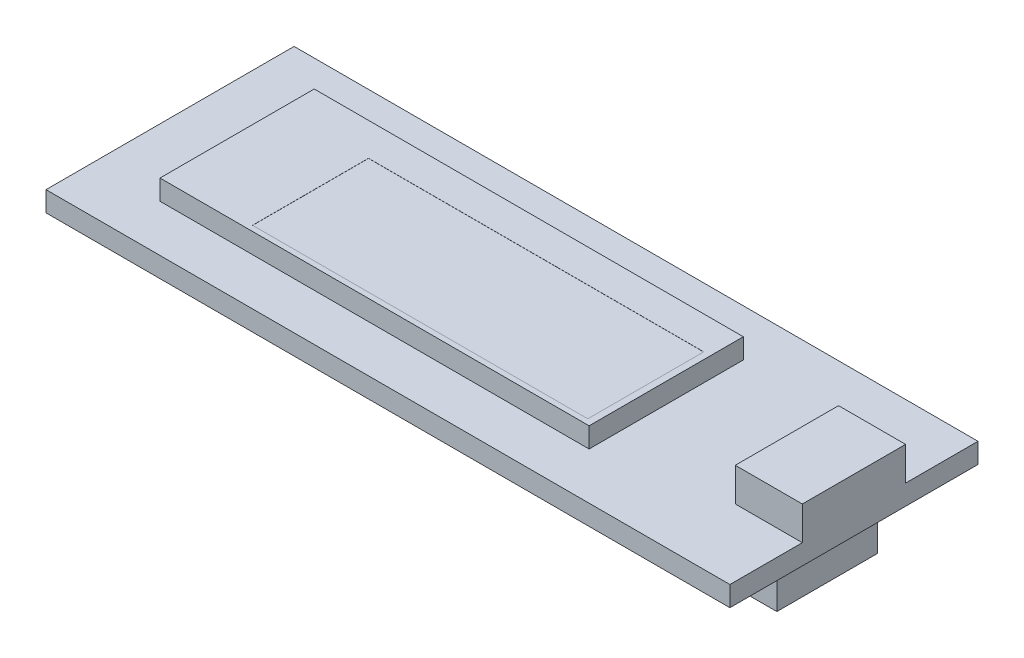
ISO-10303-21;
HEADER;
FILE_DESCRIPTION(('STEP AP214'),'2;1');
FILE_NAME('part.step','',(''),(''),'','','');
FILE_SCHEMA(('AUTOMOTIVE_DESIGN { 1 0 10303 214 1 1 1 1 }'));
ENDSEC;
DATA;
#1=APPLICATION_CONTEXT('core data for automotive mechanical design processes');
#2=APPLICATION_PROTOCOL_DEFINITION('international standard','automotive_design',2000,#1);
#3=PRODUCT_CONTEXT('',#1,'mechanical');
#4=PRODUCT('Part','Part','',(#3));
#5=PRODUCT_RELATED_PRODUCT_CATEGORY('part','',(#4));
#6=PRODUCT_DEFINITION_FORMATION('','',#4);
#7=PRODUCT_DEFINITION_CONTEXT('part definition',#1,'design');
#8=PRODUCT_DEFINITION('design','',#6,#7);
#9=PRODUCT_DEFINITION_SHAPE('','',#8);
#10=(LENGTH_UNIT() NAMED_UNIT(*) SI_UNIT(.MILLI.,.METRE.));
#11=(NAMED_UNIT(*) PLANE_ANGLE_UNIT() SI_UNIT($,.RADIAN.));
#12=(NAMED_UNIT(*) SI_UNIT($,.STERADIAN.) SOLID_ANGLE_UNIT());
#13=UNCERTAINTY_MEASURE_WITH_UNIT(LENGTH_MEASURE(1.E-05),#10,'distance_accuracy_value','');
#14=(GEOMETRIC_REPRESENTATION_CONTEXT(3) GLOBAL_UNCERTAINTY_ASSIGNED_CONTEXT((#13)) GLOBAL_UNIT_ASSIGNED_CONTEXT((#10,
#11,#12)) REPRESENTATION_CONTEXT('',''));
#15=CARTESIAN_POINT('',(0.,0.,0.));
#16=DIRECTION('',(0.,0.,1.));
#17=DIRECTION('',(1.,0.,0.));
#18=AXIS2_PLACEMENT_3D('',#15,#16,#17);
#19=CARTESIAN_POINT('',(0.,0.,0.));
#20=DIRECTION('',(0.,-1.,0.));
#21=DIRECTION('',(0.,0.,-1.));
#22=AXIS2_PLACEMENT_3D('',#19,#20,#21);
#23=PLANE('',#22);
#24=DIRECTION('',(1.,0.,0.));
#25=VECTOR('',#24,1.);
#26=CARTESIAN_POINT('',(0.,0.,-9.25));
#27=LINE('',#26,#25);
#28=CARTESIAN_POINT('',(0.,0.,-9.25));
#29=VERTEX_POINT('',#28);
#30=CARTESIAN_POINT('',(51.,0.,-9.25));
#31=VERTEX_POINT('',#30);
#32=EDGE_CURVE('E299',#29,#31,#27,.T.);
#33=ORIENTED_EDGE('',*,*,#32,.T.);
#34=DIRECTION('',(0.,0.,1.));
#35=VECTOR('',#34,1.);
#36=CARTESIAN_POINT('',(51.,0.,-9.25));
#37=LINE('',#36,#35);
#38=CARTESIAN_POINT('',(51.,0.,9.24999999999997));
#39=VERTEX_POINT('',#38);
#40=EDGE_CURVE('E315',#31,#39,#37,.T.);
#41=ORIENTED_EDGE('',*,*,#40,.T.);
#42=DIRECTION('',(1.,0.,0.));
#43=VECTOR('',#42,1.);
#44=CARTESIAN_POINT('',(0.,0.,9.25));
#45=LINE('',#44,#43);
#46=CARTESIAN_POINT('',(0.,0.,9.25));
#47=VERTEX_POINT('',#46);
#48=EDGE_CURVE('E318',#47,#39,#45,.T.);
#49=ORIENTED_EDGE('',*,*,#48,.F.);
#50=DIRECTION('',(0.,0.,1.));
#51=VECTOR('',#50,1.);
#52=CARTESIAN_POINT('',(0.,0.,-9.25));
#53=LINE('',#52,#51);
#54=EDGE_CURVE('E304',#29,#47,#53,.T.);
#55=ORIENTED_EDGE('',*,*,#54,.F.);
#56=EDGE_LOOP('',(#33,#41,#49,#55));
#57=FACE_BOUND('',#56,.T.);
#58=DIRECTION('',(1.,0.,0.));
#59=VECTOR('',#58,1.);
#60=CARTESIAN_POINT('',(44.7,0.,-3.75));
#61=LINE('',#60,#59);
#62=CARTESIAN_POINT('',(44.7,0.,-3.75));
#63=VERTEX_POINT('',#62);
#64=CARTESIAN_POINT('',(49.,0.,-3.75));
#65=VERTEX_POINT('',#64);
#66=EDGE_CURVE('E227',#63,#65,#61,.T.);
#67=ORIENTED_EDGE('',*,*,#66,.F.);
#68=DIRECTION('',(0.,0.,-1.));
#69=VECTOR('',#68,1.);
#70=CARTESIAN_POINT('',(44.7,0.,3.75));
#71=LINE('',#70,#69);
#72=CARTESIAN_POINT('',(44.7,0.,3.75));
#73=VERTEX_POINT('',#72);
#74=EDGE_CURVE('E210',#73,#63,#71,.T.);
#75=ORIENTED_EDGE('',*,*,#74,.F.);
#76=DIRECTION('',(-1.,0.,0.));
#77=VECTOR('',#76,1.);
#78=CARTESIAN_POINT('',(44.7,0.,3.75));
#79=LINE('',#78,#77);
#80=CARTESIAN_POINT('',(49.,0.,3.75));
#81=VERTEX_POINT('',#80);
#82=EDGE_CURVE('E218',#81,#73,#79,.T.);
#83=ORIENTED_EDGE('',*,*,#82,.F.);
#84=DIRECTION('',(0.,0.,1.));
#85=VECTOR('',#84,1.);
#86=CARTESIAN_POINT('',(49.,0.,3.75));
#87=LINE('',#86,#85);
#88=EDGE_CURVE('E229',#65,#81,#87,.T.);
#89=ORIENTED_EDGE('',*,*,#88,.F.);
#90=EDGE_LOOP('',(#67,#75,#83,#89));
#91=FACE_BOUND('',#90,.T.);
#92=ADVANCED_FACE('F36',(#57,#91),#23,.T.);
#93=CARTESIAN_POINT('',(0.,1.5,0.));
#94=DIRECTION('',(0.,-1.,0.));
#95=DIRECTION('',(0.,0.,-1.));
#96=AXIS2_PLACEMENT_3D('',#93,#94,#95);
#97=PLANE('',#96);
#98=DIRECTION('',(0.,0.,1.));
#99=VECTOR('',#98,1.);
#100=CARTESIAN_POINT('',(5.,1.5,-5.75));
#101=LINE('',#100,#99);
#102=CARTESIAN_POINT('',(5.,1.5,-5.75));
#103=VERTEX_POINT('',#102);
#104=CARTESIAN_POINT('',(5.,1.5,5.75));
#105=VERTEX_POINT('',#104);
#106=EDGE_CURVE('E266',#103,#105,#101,.T.);
#107=ORIENTED_EDGE('',*,*,#106,.F.);
#108=DIRECTION('',(-1.,0.,0.));
#109=VECTOR('',#108,1.);
#110=CARTESIAN_POINT('',(5.,1.5,-5.75));
#111=LINE('',#110,#109);
#112=CARTESIAN_POINT('',(37.,1.5,-5.75));
#113=VERTEX_POINT('',#112);
#114=EDGE_CURVE('E271',#113,#103,#111,.T.);
#115=ORIENTED_EDGE('',*,*,#114,.F.);
#116=DIRECTION('',(0.,0.,-1.));
#117=VECTOR('',#116,1.);
#118=CARTESIAN_POINT('',(37.,1.5,-5.75));
#119=LINE('',#118,#117);
#120=CARTESIAN_POINT('',(37.,1.5,5.75));
#121=VERTEX_POINT('',#120);
#122=EDGE_CURVE('E283',#121,#113,#119,.T.);
#123=ORIENTED_EDGE('',*,*,#122,.F.);
#124=DIRECTION('',(1.,0.,0.));
#125=VECTOR('',#124,1.);
#126=CARTESIAN_POINT('',(5.,1.5,5.75));
#127=LINE('',#126,#125);
#128=EDGE_CURVE('E280',#105,#121,#127,.T.);
#129=ORIENTED_EDGE('',*,*,#128,.F.);
#130=EDGE_LOOP('',(#107,#115,#123,#129));
#131=FACE_BOUND('',#130,.T.);
#132=DIRECTION('',(-1.,0.,0.));
#133=VECTOR('',#132,1.);
#134=CARTESIAN_POINT('',(51.,1.5,-3.85));
#135=LINE('',#134,#133);
#136=CARTESIAN_POINT('',(51.,1.5,-3.85));
#137=VERTEX_POINT('',#136);
#138=CARTESIAN_POINT('',(46.,1.5,-3.85));
#139=VERTEX_POINT('',#138);
#140=EDGE_CURVE('E240',#137,#139,#135,.T.);
#141=ORIENTED_EDGE('',*,*,#140,.F.);
#142=DIRECTION('',(0.,0.,1.));
#143=VECTOR('',#142,1.);
#144=CARTESIAN_POINT('',(51.,1.5,-9.25));
#145=LINE('',#144,#143);
#146=CARTESIAN_POINT('',(51.,1.5,-9.25));
#147=VERTEX_POINT('',#146);
#148=EDGE_CURVE('E305',#147,#137,#145,.T.);
#149=ORIENTED_EDGE('',*,*,#148,.F.);
#150=DIRECTION('',(1.,0.,0.));
#151=VECTOR('',#150,1.);
#152=CARTESIAN_POINT('',(0.,1.5,-9.25));
#153=LINE('',#152,#151);
#154=CARTESIAN_POINT('',(0.,1.5,-9.25));
#155=VERTEX_POINT('',#154);
#156=EDGE_CURVE('E300',#155,#147,#153,.T.);
#157=ORIENTED_EDGE('',*,*,#156,.F.);
#158=DIRECTION('',(0.,0.,1.));
#159=VECTOR('',#158,1.);
#160=CARTESIAN_POINT('',(0.,1.5,-9.25));
#161=LINE('',#160,#159);
#162=CARTESIAN_POINT('',(0.,1.5,9.25));
#163=VERTEX_POINT('',#162);
#164=EDGE_CURVE('E311',#155,#163,#161,.T.);
#165=ORIENTED_EDGE('',*,*,#164,.T.);
#166=DIRECTION('',(1.,0.,0.));
#167=VECTOR('',#166,1.);
#168=CARTESIAN_POINT('',(0.,1.5,9.25));
#169=LINE('',#168,#167);
#170=CARTESIAN_POINT('',(51.,1.5,9.24999999999997));
#171=VERTEX_POINT('',#170);
#172=EDGE_CURVE('E308',#163,#171,#169,.T.);
#173=ORIENTED_EDGE('',*,*,#172,.T.);
#174=CARTESIAN_POINT('',(51.,1.5,3.85));
#175=VERTEX_POINT('',#174);
#176=EDGE_CURVE('E303',#175,#171,#145,.T.);
#177=ORIENTED_EDGE('',*,*,#176,.F.);
#178=DIRECTION('',(1.,0.,0.));
#179=VECTOR('',#178,1.);
#180=CARTESIAN_POINT('',(51.,1.5,3.85));
#181=LINE('',#180,#179);
#182=CARTESIAN_POINT('',(46.,1.5,3.85));
#183=VERTEX_POINT('',#182);
#184=EDGE_CURVE('E245',#183,#175,#181,.T.);
#185=ORIENTED_EDGE('',*,*,#184,.F.);
#186=DIRECTION('',(0.,0.,1.));
#187=VECTOR('',#186,1.);
#188=CARTESIAN_POINT('',(46.,1.5,-3.85));
#189=LINE('',#188,#187);
#190=EDGE_CURVE('E253',#139,#183,#189,.T.);
#191=ORIENTED_EDGE('',*,*,#190,.F.);
#192=EDGE_LOOP('',(#141,#149,#157,#165,#173,#177,#185,#191));
#193=FACE_BOUND('',#192,.T.);
#194=ADVANCED_FACE('F346',(#131,#193),#97,.F.);
#195=CARTESIAN_POINT('',(0.,1.5,-9.25));
#196=DIRECTION('',(0.,0.,-1.));
#197=DIRECTION('',(-1.,0.,0.));
#198=AXIS2_PLACEMENT_3D('',#195,#196,#197);
#199=PLANE('',#198);
#200=ORIENTED_EDGE('',*,*,#32,.F.);
#201=DIRECTION('',(0.,-1.,0.));
#202=VECTOR('',#201,1.);
#203=CARTESIAN_POINT('',(0.,1.5,-9.25));
#204=LINE('',#203,#202);
#205=EDGE_CURVE('E11',#155,#29,#204,.T.);
#206=ORIENTED_EDGE('',*,*,#205,.F.);
#207=ORIENTED_EDGE('',*,*,#156,.T.);
#208=DIRECTION('',(0.,-1.,0.));
#209=VECTOR('',#208,1.);
#210=CARTESIAN_POINT('',(51.,1.5,-9.25));
#211=LINE('',#210,#209);
#212=EDGE_CURVE('E40',#147,#31,#211,.T.);
#213=ORIENTED_EDGE('',*,*,#212,.T.);
#214=EDGE_LOOP('',(#200,#206,#207,#213));
#215=FACE_BOUND('',#214,.T.);
#216=ADVANCED_FACE('F38',(#215),#199,.T.);
#217=CARTESIAN_POINT('',(0.,1.5,-9.25));
#218=DIRECTION('',(1.,0.,0.));
#219=DIRECTION('',(0.,0.,-1.));
#220=AXIS2_PLACEMENT_3D('',#217,#218,#219);
#221=PLANE('',#220);
#222=ORIENTED_EDGE('',*,*,#54,.T.);
#223=DIRECTION('',(0.,-1.,0.));
#224=VECTOR('',#223,1.);
#225=CARTESIAN_POINT('',(0.,1.5,9.25));
#226=LINE('',#225,#224);
#227=EDGE_CURVE('E45',#163,#47,#226,.T.);
#228=ORIENTED_EDGE('',*,*,#227,.F.);
#229=ORIENTED_EDGE('',*,*,#164,.F.);
#230=ORIENTED_EDGE('',*,*,#205,.T.);
#231=EDGE_LOOP('',(#222,#228,#229,#230));
#232=FACE_BOUND('',#231,.T.);
#233=ADVANCED_FACE('F338',(#232),#221,.F.);
#234=CARTESIAN_POINT('',(0.,1.5,9.25));
#235=DIRECTION('',(0.,0.,-1.));
#236=DIRECTION('',(-1.,0.,0.));
#237=AXIS2_PLACEMENT_3D('',#234,#235,#236);
#238=PLANE('',#237);
#239=ORIENTED_EDGE('',*,*,#48,.T.);
#240=DIRECTION('',(0.,-1.,0.));
#241=VECTOR('',#240,1.);
#242=CARTESIAN_POINT('',(51.,1.5,9.24999999999997));
#243=LINE('',#242,#241);
#244=EDGE_CURVE('E323',#171,#39,#243,.T.);
#245=ORIENTED_EDGE('',*,*,#244,.F.);
#246=ORIENTED_EDGE('',*,*,#172,.F.);
#247=ORIENTED_EDGE('',*,*,#227,.T.);
#248=EDGE_LOOP('',(#239,#245,#246,#247));
#249=FACE_BOUND('',#248,.T.);
#250=ADVANCED_FACE('F342',(#249),#238,.F.);
#251=CARTESIAN_POINT('',(51.,1.5,-9.25));
#252=DIRECTION('',(1.,0.,0.));
#253=DIRECTION('',(0.,0.,-1.));
#254=AXIS2_PLACEMENT_3D('',#251,#252,#253);
#255=PLANE('',#254);
#256=ORIENTED_EDGE('',*,*,#40,.F.);
#257=ORIENTED_EDGE('',*,*,#212,.F.);
#258=ORIENTED_EDGE('',*,*,#148,.T.);
#259=DIRECTION('',(0.,-1.,0.));
#260=VECTOR('',#259,1.);
#261=CARTESIAN_POINT('',(51.,4.,-3.85));
#262=LINE('',#261,#260);
#263=CARTESIAN_POINT('',(51.,4.,-3.85));
#264=VERTEX_POINT('',#263);
#265=EDGE_CURVE('E264',#264,#137,#262,.T.);
#266=ORIENTED_EDGE('',*,*,#265,.F.);
#267=DIRECTION('',(0.,0.,-1.));
#268=VECTOR('',#267,1.);
#269=CARTESIAN_POINT('',(51.,4.,-3.85));
#270=LINE('',#269,#268);
#271=CARTESIAN_POINT('',(51.,4.,3.85));
#272=VERTEX_POINT('',#271);
#273=EDGE_CURVE('E241',#272,#264,#270,.T.);
#274=ORIENTED_EDGE('',*,*,#273,.F.);
#275=DIRECTION('',(0.,-1.,0.));
#276=VECTOR('',#275,1.);
#277=CARTESIAN_POINT('',(51.,4.,3.85));
#278=LINE('',#277,#276);
#279=EDGE_CURVE('E251',#272,#175,#278,.T.);
#280=ORIENTED_EDGE('',*,*,#279,.T.);
#281=ORIENTED_EDGE('',*,*,#176,.T.);
#282=ORIENTED_EDGE('',*,*,#244,.T.);
#283=EDGE_LOOP('',(#256,#257,#258,#266,#274,#280,#281,#282));
#284=FACE_BOUND('',#283,.T.);
#285=ADVANCED_FACE('F331',(#284),#255,.T.);
#286=CARTESIAN_POINT('',(5.,3.,-5.75));
#287=DIRECTION('',(1.,0.,0.));
#288=DIRECTION('',(0.,0.,-1.));
#289=AXIS2_PLACEMENT_3D('',#286,#287,#288);
#290=PLANE('',#289);
#291=ORIENTED_EDGE('',*,*,#106,.T.);
#292=DIRECTION('',(0.,-1.,0.));
#293=VECTOR('',#292,1.);
#294=CARTESIAN_POINT('',(5.,3.,5.75));
#295=LINE('',#294,#293);
#296=CARTESIAN_POINT('',(5.,3.,5.75));
#297=VERTEX_POINT('',#296);
#298=EDGE_CURVE('E296',#297,#105,#295,.T.);
#299=ORIENTED_EDGE('',*,*,#298,.F.);
#300=DIRECTION('',(0.,0.,1.));
#301=VECTOR('',#300,1.);
#302=CARTESIAN_POINT('',(5.,3.,-5.75));
#303=LINE('',#302,#301);
#304=CARTESIAN_POINT('',(5.,3.,-5.75));
#305=VERTEX_POINT('',#304);
#306=EDGE_CURVE('E267',#305,#297,#303,.T.);
#307=ORIENTED_EDGE('',*,*,#306,.F.);
#308=DIRECTION('',(0.,-1.,0.));
#309=VECTOR('',#308,1.);
#310=CARTESIAN_POINT('',(5.,3.,-5.75));
#311=LINE('',#310,#309);
#312=EDGE_CURVE('E277',#305,#103,#311,.T.);
#313=ORIENTED_EDGE('',*,*,#312,.T.);
#314=EDGE_LOOP('',(#291,#299,#307,#313));
#315=FACE_BOUND('',#314,.T.);
#316=ADVANCED_FACE('F386',(#315),#290,.F.);
#317=CARTESIAN_POINT('',(5.,3.,5.75));
#318=DIRECTION('',(0.,0.,-1.));
#319=DIRECTION('',(-1.,0.,0.));
#320=AXIS2_PLACEMENT_3D('',#317,#318,#319);
#321=PLANE('',#320);
#322=ORIENTED_EDGE('',*,*,#128,.T.);
#323=DIRECTION('',(0.,-1.,0.));
#324=VECTOR('',#323,1.);
#325=CARTESIAN_POINT('',(37.,3.,5.75));
#326=LINE('',#325,#324);
#327=CARTESIAN_POINT('',(37.,3.,5.75));
#328=VERTEX_POINT('',#327);
#329=EDGE_CURVE('E293',#328,#121,#326,.T.);
#330=ORIENTED_EDGE('',*,*,#329,.F.);
#331=DIRECTION('',(1.,0.,0.));
#332=VECTOR('',#331,1.);
#333=CARTESIAN_POINT('',(5.,3.,5.75));
#334=LINE('',#333,#332);
#335=EDGE_CURVE('E270',#297,#328,#334,.T.);
#336=ORIENTED_EDGE('',*,*,#335,.F.);
#337=ORIENTED_EDGE('',*,*,#298,.T.);
#338=EDGE_LOOP('',(#322,#330,#336,#337));
#339=FACE_BOUND('',#338,.T.);
#340=ADVANCED_FACE('F390',(#339),#321,.F.);
#341=CARTESIAN_POINT('',(37.,3.,-5.75));
#342=DIRECTION('',(-1.,0.,0.));
#343=DIRECTION('',(0.,0.,1.));
#344=AXIS2_PLACEMENT_3D('',#341,#342,#343);
#345=PLANE('',#344);
#346=ORIENTED_EDGE('',*,*,#122,.T.);
#347=DIRECTION('',(0.,-1.,0.));
#348=VECTOR('',#347,1.);
#349=CARTESIAN_POINT('',(37.,3.,-5.75));
#350=LINE('',#349,#348);
#351=CARTESIAN_POINT('',(37.,3.,-5.75));
#352=VERTEX_POINT('',#351);
#353=EDGE_CURVE('E290',#352,#113,#350,.T.);
#354=ORIENTED_EDGE('',*,*,#353,.F.);
#355=DIRECTION('',(0.,0.,-1.));
#356=VECTOR('',#355,1.);
#357=CARTESIAN_POINT('',(37.,3.,-5.75));
#358=LINE('',#357,#356);
#359=EDGE_CURVE('E273',#328,#352,#358,.T.);
#360=ORIENTED_EDGE('',*,*,#359,.F.);
#361=ORIENTED_EDGE('',*,*,#329,.T.);
#362=EDGE_LOOP('',(#346,#354,#360,#361));
#363=FACE_BOUND('',#362,.T.);
#364=ADVANCED_FACE('F395',(#363),#345,.F.);
#365=CARTESIAN_POINT('',(5.,3.,-5.75));
#366=DIRECTION('',(0.,0.,1.));
#367=DIRECTION('',(1.,0.,0.));
#368=AXIS2_PLACEMENT_3D('',#365,#366,#367);
#369=PLANE('',#368);
#370=ORIENTED_EDGE('',*,*,#114,.T.);
#371=ORIENTED_EDGE('',*,*,#312,.F.);
#372=DIRECTION('',(-1.,0.,0.));
#373=VECTOR('',#372,1.);
#374=CARTESIAN_POINT('',(5.,3.,-5.75));
#375=LINE('',#374,#373);
#376=EDGE_CURVE('E275',#352,#305,#375,.T.);
#377=ORIENTED_EDGE('',*,*,#376,.F.);
#378=ORIENTED_EDGE('',*,*,#353,.T.);
#379=EDGE_LOOP('',(#370,#371,#377,#378));
#380=FACE_BOUND('',#379,.T.);
#381=ADVANCED_FACE('F401',(#380),#369,.F.);
#382=CARTESIAN_POINT('',(0.,3.,0.));
#383=DIRECTION('',(0.,1.,0.));
#384=DIRECTION('',(0.,0.,1.));
#385=AXIS2_PLACEMENT_3D('',#382,#383,#384);
#386=PLANE('',#385);
#387=DIRECTION('',(0.,0.,-1.));
#388=VECTOR('',#387,1.);
#389=CARTESIAN_POINT('',(36.5,3.,5.35));
#390=LINE('',#389,#388);
#391=CARTESIAN_POINT('',(36.5,3.,5.35));
#392=VERTEX_POINT('',#391);
#393=CARTESIAN_POINT('',(36.5,3.,-3.3));
#394=VERTEX_POINT('',#393);
#395=EDGE_CURVE('E53',#392,#394,#390,.T.);
#396=ORIENTED_EDGE('',*,*,#395,.F.);
#397=DIRECTION('',(1.,0.,0.));
#398=VECTOR('',#397,1.);
#399=CARTESIAN_POINT('',(36.5,3.,5.35));
#400=LINE('',#399,#398);
#401=CARTESIAN_POINT('',(11.5,3.,5.35));
#402=VERTEX_POINT('',#401);
#403=EDGE_CURVE('E195',#402,#392,#400,.T.);
#404=ORIENTED_EDGE('',*,*,#403,.F.);
#405=DIRECTION('',(0.,0.,1.));
#406=VECTOR('',#405,1.);
#407=CARTESIAN_POINT('',(11.5,3.,5.35));
#408=LINE('',#407,#406);
#409=CARTESIAN_POINT('',(11.5,3.,-3.3));
#410=VERTEX_POINT('',#409);
#411=EDGE_CURVE('E198',#410,#402,#408,.T.);
#412=ORIENTED_EDGE('',*,*,#411,.F.);
#413=DIRECTION('',(-1.,0.,0.));
#414=VECTOR('',#413,1.);
#415=CARTESIAN_POINT('',(36.5,3.,-3.3));
#416=LINE('',#415,#414);
#417=EDGE_CURVE('E204',#394,#410,#416,.T.);
#418=ORIENTED_EDGE('',*,*,#417,.F.);
#419=EDGE_LOOP('',(#396,#404,#412,#418));
#420=FACE_BOUND('',#419,.T.);
#421=ORIENTED_EDGE('',*,*,#306,.T.);
#422=ORIENTED_EDGE('',*,*,#335,.T.);
#423=ORIENTED_EDGE('',*,*,#359,.T.);
#424=ORIENTED_EDGE('',*,*,#376,.T.);
#425=EDGE_LOOP('',(#421,#422,#423,#424));
#426=FACE_BOUND('',#425,.T.);
#427=ADVANCED_FACE('F371',(#420,#426),#386,.T.);
#428=CARTESIAN_POINT('',(51.,4.,-3.85));
#429=DIRECTION('',(0.,0.,1.));
#430=DIRECTION('',(1.,0.,0.));
#431=AXIS2_PLACEMENT_3D('',#428,#429,#430);
#432=PLANE('',#431);
#433=ORIENTED_EDGE('',*,*,#140,.T.);
#434=DIRECTION('',(0.,-1.,0.));
#435=VECTOR('',#434,1.);
#436=CARTESIAN_POINT('',(46.,4.,-3.85));
#437=LINE('',#436,#435);
#438=CARTESIAN_POINT('',(46.,4.,-3.85));
#439=VERTEX_POINT('',#438);
#440=EDGE_CURVE('E261',#439,#139,#437,.T.);
#441=ORIENTED_EDGE('',*,*,#440,.F.);
#442=DIRECTION('',(-1.,0.,0.));
#443=VECTOR('',#442,1.);
#444=CARTESIAN_POINT('',(51.,4.,-3.85));
#445=LINE('',#444,#443);
#446=EDGE_CURVE('E244',#264,#439,#445,.T.);
#447=ORIENTED_EDGE('',*,*,#446,.F.);
#448=ORIENTED_EDGE('',*,*,#265,.T.);
#449=EDGE_LOOP('',(#433,#441,#447,#448));
#450=FACE_BOUND('',#449,.T.);
#451=ADVANCED_FACE('F352',(#450),#432,.F.);
#452=CARTESIAN_POINT('',(46.,4.,-3.85));
#453=DIRECTION('',(1.,0.,0.));
#454=DIRECTION('',(0.,0.,-1.));
#455=AXIS2_PLACEMENT_3D('',#452,#453,#454);
#456=PLANE('',#455);
#457=ORIENTED_EDGE('',*,*,#190,.T.);
#458=DIRECTION('',(0.,-1.,0.));
#459=VECTOR('',#458,1.);
#460=CARTESIAN_POINT('',(46.,4.,3.85));
#461=LINE('',#460,#459);
#462=CARTESIAN_POINT('',(46.,4.,3.85));
#463=VERTEX_POINT('',#462);
#464=EDGE_CURVE('E258',#463,#183,#461,.T.);
#465=ORIENTED_EDGE('',*,*,#464,.F.);
#466=DIRECTION('',(0.,0.,1.));
#467=VECTOR('',#466,1.);
#468=CARTESIAN_POINT('',(46.,4.,-3.85));
#469=LINE('',#468,#467);
#470=EDGE_CURVE('E247',#439,#463,#469,.T.);
#471=ORIENTED_EDGE('',*,*,#470,.F.);
#472=ORIENTED_EDGE('',*,*,#440,.T.);
#473=EDGE_LOOP('',(#457,#465,#471,#472));
#474=FACE_BOUND('',#473,.T.);
#475=ADVANCED_FACE('F363',(#474),#456,.F.);
#476=CARTESIAN_POINT('',(51.,4.,3.85));
#477=DIRECTION('',(0.,0.,-1.));
#478=DIRECTION('',(-1.,0.,0.));
#479=AXIS2_PLACEMENT_3D('',#476,#477,#478);
#480=PLANE('',#479);
#481=ORIENTED_EDGE('',*,*,#184,.T.);
#482=ORIENTED_EDGE('',*,*,#279,.F.);
#483=DIRECTION('',(1.,0.,0.));
#484=VECTOR('',#483,1.);
#485=CARTESIAN_POINT('',(51.,4.,3.85));
#486=LINE('',#485,#484);
#487=EDGE_CURVE('E249',#463,#272,#486,.T.);
#488=ORIENTED_EDGE('',*,*,#487,.F.);
#489=ORIENTED_EDGE('',*,*,#464,.T.);
#490=EDGE_LOOP('',(#481,#482,#488,#489));
#491=FACE_BOUND('',#490,.T.);
#492=ADVANCED_FACE('F361',(#491),#480,.F.);
#493=CARTESIAN_POINT('',(0.,4.,0.));
#494=DIRECTION('',(0.,-1.,0.));
#495=DIRECTION('',(0.,0.,-1.));
#496=AXIS2_PLACEMENT_3D('',#493,#494,#495);
#497=PLANE('',#496);
#498=ORIENTED_EDGE('',*,*,#273,.T.);
#499=ORIENTED_EDGE('',*,*,#446,.T.);
#500=ORIENTED_EDGE('',*,*,#470,.T.);
#501=ORIENTED_EDGE('',*,*,#487,.T.);
#502=EDGE_LOOP('',(#498,#499,#500,#501));
#503=FACE_BOUND('',#502,.T.);
#504=ADVANCED_FACE('F356',(#503),#497,.F.);
#505=CARTESIAN_POINT('',(44.7,-4.,3.75));
#506=DIRECTION('',(1.,0.,0.));
#507=DIRECTION('',(0.,0.,-1.));
#508=AXIS2_PLACEMENT_3D('',#505,#506,#507);
#509=PLANE('',#508);
#510=ORIENTED_EDGE('',*,*,#74,.T.);
#511=DIRECTION('',(0.,1.,0.));
#512=VECTOR('',#511,1.);
#513=CARTESIAN_POINT('',(44.7,-4.,-3.75));
#514=LINE('',#513,#512);
#515=CARTESIAN_POINT('',(44.7,-4.,-3.75));
#516=VERTEX_POINT('',#515);
#517=EDGE_CURVE('E238',#516,#63,#514,.T.);
#518=ORIENTED_EDGE('',*,*,#517,.F.);
#519=DIRECTION('',(0.,0.,-1.));
#520=VECTOR('',#519,1.);
#521=CARTESIAN_POINT('',(44.7,-4.,3.75));
#522=LINE('',#521,#520);
#523=CARTESIAN_POINT('',(44.7,-4.,3.75));
#524=VERTEX_POINT('',#523);
#525=EDGE_CURVE('E214',#524,#516,#522,.T.);
#526=ORIENTED_EDGE('',*,*,#525,.F.);
#527=DIRECTION('',(0.,1.,0.));
#528=VECTOR('',#527,1.);
#529=CARTESIAN_POINT('',(44.7,-4.,3.75));
#530=LINE('',#529,#528);
#531=EDGE_CURVE('E224',#524,#73,#530,.T.);
#532=ORIENTED_EDGE('',*,*,#531,.T.);
#533=EDGE_LOOP('',(#510,#518,#526,#532));
#534=FACE_BOUND('',#533,.T.);
#535=ADVANCED_FACE('F450',(#534),#509,.F.);
#536=CARTESIAN_POINT('',(44.7,-4.,-3.75));
#537=DIRECTION('',(0.,0.,1.));
#538=DIRECTION('',(1.,0.,0.));
#539=AXIS2_PLACEMENT_3D('',#536,#537,#538);
#540=PLANE('',#539);
#541=ORIENTED_EDGE('',*,*,#66,.T.);
#542=DIRECTION('',(0.,1.,0.));
#543=VECTOR('',#542,1.);
#544=CARTESIAN_POINT('',(49.,-4.,-3.75));
#545=LINE('',#544,#543);
#546=CARTESIAN_POINT('',(49.,-4.,-3.75));
#547=VERTEX_POINT('',#546);
#548=EDGE_CURVE('E235',#547,#65,#545,.T.);
#549=ORIENTED_EDGE('',*,*,#548,.F.);
#550=DIRECTION('',(1.,0.,0.));
#551=VECTOR('',#550,1.);
#552=CARTESIAN_POINT('',(44.7,-4.,-3.75));
#553=LINE('',#552,#551);
#554=EDGE_CURVE('E217',#516,#547,#553,.T.);
#555=ORIENTED_EDGE('',*,*,#554,.F.);
#556=ORIENTED_EDGE('',*,*,#517,.T.);
#557=EDGE_LOOP('',(#541,#549,#555,#556));
#558=FACE_BOUND('',#557,.T.);
#559=ADVANCED_FACE('F446',(#558),#540,.F.);
#560=CARTESIAN_POINT('',(49.,-4.,3.75));
#561=DIRECTION('',(-1.,0.,0.));
#562=DIRECTION('',(0.,0.,1.));
#563=AXIS2_PLACEMENT_3D('',#560,#561,#562);
#564=PLANE('',#563);
#565=ORIENTED_EDGE('',*,*,#88,.T.);
#566=DIRECTION('',(0.,1.,0.));
#567=VECTOR('',#566,1.);
#568=CARTESIAN_POINT('',(49.,-4.,3.75));
#569=LINE('',#568,#567);
#570=CARTESIAN_POINT('',(49.,-4.,3.75));
#571=VERTEX_POINT('',#570);
#572=EDGE_CURVE('E61',#571,#81,#569,.T.);
#573=ORIENTED_EDGE('',*,*,#572,.F.);
#574=DIRECTION('',(0.,0.,1.));
#575=VECTOR('',#574,1.);
#576=CARTESIAN_POINT('',(49.,-4.,3.75));
#577=LINE('',#576,#575);
#578=EDGE_CURVE('E220',#547,#571,#577,.T.);
#579=ORIENTED_EDGE('',*,*,#578,.F.);
#580=ORIENTED_EDGE('',*,*,#548,.T.);
#581=EDGE_LOOP('',(#565,#573,#579,#580));
#582=FACE_BOUND('',#581,.T.);
#583=ADVANCED_FACE('F443',(#582),#564,.F.);
#584=CARTESIAN_POINT('',(44.7,-4.,3.75));
#585=DIRECTION('',(0.,0.,-1.));
#586=DIRECTION('',(-1.,0.,0.));
#587=AXIS2_PLACEMENT_3D('',#584,#585,#586);
#588=PLANE('',#587);
#589=ORIENTED_EDGE('',*,*,#82,.T.);
#590=ORIENTED_EDGE('',*,*,#531,.F.);
#591=DIRECTION('',(-1.,0.,0.));
#592=VECTOR('',#591,1.);
#593=CARTESIAN_POINT('',(44.7,-4.,3.75));
#594=LINE('',#593,#592);
#595=EDGE_CURVE('E222',#571,#524,#594,.T.);
#596=ORIENTED_EDGE('',*,*,#595,.F.);
#597=ORIENTED_EDGE('',*,*,#572,.T.);
#598=EDGE_LOOP('',(#589,#590,#596,#597));
#599=FACE_BOUND('',#598,.T.);
#600=ADVANCED_FACE('F439',(#599),#588,.F.);
#601=CARTESIAN_POINT('',(0.,-4.,0.));
#602=DIRECTION('',(0.,-1.,0.));
#603=DIRECTION('',(0.,0.,-1.));
#604=AXIS2_PLACEMENT_3D('',#601,#602,#603);
#605=PLANE('',#604);
#606=ORIENTED_EDGE('',*,*,#525,.T.);
#607=ORIENTED_EDGE('',*,*,#554,.T.);
#608=ORIENTED_EDGE('',*,*,#578,.T.);
#609=ORIENTED_EDGE('',*,*,#595,.T.);
#610=EDGE_LOOP('',(#606,#607,#608,#609));
#611=FACE_BOUND('',#610,.T.);
#612=ADVANCED_FACE('F431',(#611),#605,.T.);
#613=CARTESIAN_POINT('',(36.5,2.99,5.35));
#614=DIRECTION('',(1.,0.,0.));
#615=DIRECTION('',(0.,0.,-1.));
#616=AXIS2_PLACEMENT_3D('',#613,#614,#615);
#617=PLANE('',#616);
#618=ORIENTED_EDGE('',*,*,#395,.T.);
#619=DIRECTION('',(0.,1.,0.));
#620=VECTOR('',#619,1.);
#621=CARTESIAN_POINT('',(36.5,2.99,-3.3));
#622=LINE('',#621,#620);
#623=CARTESIAN_POINT('',(36.5,2.99,-3.3));
#624=VERTEX_POINT('',#623);
#625=EDGE_CURVE('E173',#624,#394,#622,.T.);
#626=ORIENTED_EDGE('',*,*,#625,.F.);
#627=DIRECTION('',(0.,0.,-1.));
#628=VECTOR('',#627,1.);
#629=CARTESIAN_POINT('',(36.5,2.99,5.35));
#630=LINE('',#629,#628);
#631=CARTESIAN_POINT('',(36.5,2.99,5.35));
#632=VERTEX_POINT('',#631);
#633=EDGE_CURVE('E177',#632,#624,#630,.T.);
#634=ORIENTED_EDGE('',*,*,#633,.F.);
#635=DIRECTION('',(0.,1.,0.));
#636=VECTOR('',#635,1.);
#637=CARTESIAN_POINT('',(36.5,2.99,5.35));
#638=LINE('',#637,#636);
#639=EDGE_CURVE('E208',#632,#392,#638,.T.);
#640=ORIENTED_EDGE('',*,*,#639,.T.);
#641=EDGE_LOOP('',(#618,#626,#634,#640));
#642=FACE_BOUND('',#641,.T.);
#643=ADVANCED_FACE('F175',(#642),#617,.F.);
#644=CARTESIAN_POINT('',(36.5,2.99,5.35));
#645=DIRECTION('',(0.,0.,1.));
#646=DIRECTION('',(1.,0.,0.));
#647=AXIS2_PLACEMENT_3D('',#644,#645,#646);
#648=PLANE('',#647);
#649=ORIENTED_EDGE('',*,*,#403,.T.);
#650=ORIENTED_EDGE('',*,*,#639,.F.);
#651=DIRECTION('',(1.,0.,0.));
#652=VECTOR('',#651,1.);
#653=CARTESIAN_POINT('',(36.5,2.99,5.35));
#654=LINE('',#653,#652);
#655=CARTESIAN_POINT('',(11.5,2.99,5.35));
#656=VERTEX_POINT('',#655);
#657=EDGE_CURVE('E183',#656,#632,#654,.T.);
#658=ORIENTED_EDGE('',*,*,#657,.F.);
#659=DIRECTION('',(0.,1.,0.));
#660=VECTOR('',#659,1.);
#661=CARTESIAN_POINT('',(11.5,2.99,5.35));
#662=LINE('',#661,#660);
#663=EDGE_CURVE('E211',#656,#402,#662,.T.);
#664=ORIENTED_EDGE('',*,*,#663,.T.);
#665=EDGE_LOOP('',(#649,#650,#658,#664));
#666=FACE_BOUND('',#665,.T.);
#667=ADVANCED_FACE('F423',(#666),#648,.F.);
#668=CARTESIAN_POINT('',(11.5,2.99,5.35));
#669=DIRECTION('',(-1.,0.,0.));
#670=DIRECTION('',(0.,0.,1.));
#671=AXIS2_PLACEMENT_3D('',#668,#669,#670);
#672=PLANE('',#671);
#673=ORIENTED_EDGE('',*,*,#411,.T.);
#674=ORIENTED_EDGE('',*,*,#663,.F.);
#675=DIRECTION('',(0.,0.,1.));
#676=VECTOR('',#675,1.);
#677=CARTESIAN_POINT('',(11.5,2.99,5.35));
#678=LINE('',#677,#676);
#679=CARTESIAN_POINT('',(11.5,2.99,-3.3));
#680=VERTEX_POINT('',#679);
#681=EDGE_CURVE('E191',#680,#656,#678,.T.);
#682=ORIENTED_EDGE('',*,*,#681,.F.);
#683=DIRECTION('',(0.,1.,0.));
#684=VECTOR('',#683,1.);
#685=CARTESIAN_POINT('',(11.5,2.99,-3.3));
#686=LINE('',#685,#684);
#687=EDGE_CURVE('E182',#680,#410,#686,.T.);
#688=ORIENTED_EDGE('',*,*,#687,.T.);
#689=EDGE_LOOP('',(#673,#674,#682,#688));
#690=FACE_BOUND('',#689,.T.);
#691=ADVANCED_FACE('F421',(#690),#672,.F.);
#692=CARTESIAN_POINT('',(36.5,2.99,-3.3));
#693=DIRECTION('',(0.,0.,-1.));
#694=DIRECTION('',(-1.,0.,0.));
#695=AXIS2_PLACEMENT_3D('',#692,#693,#694);
#696=PLANE('',#695);
#697=ORIENTED_EDGE('',*,*,#417,.T.);
#698=ORIENTED_EDGE('',*,*,#687,.F.);
#699=DIRECTION('',(-1.,0.,0.));
#700=VECTOR('',#699,1.);
#701=CARTESIAN_POINT('',(36.5,2.99,-3.3));
#702=LINE('',#701,#700);
#703=EDGE_CURVE('E186',#624,#680,#702,.T.);
#704=ORIENTED_EDGE('',*,*,#703,.F.);
#705=ORIENTED_EDGE('',*,*,#625,.T.);
#706=EDGE_LOOP('',(#697,#698,#704,#705));
#707=FACE_BOUND('',#706,.T.);
#708=ADVANCED_FACE('F187',(#707),#696,.F.);
#709=CARTESIAN_POINT('',(0.,2.99,0.));
#710=DIRECTION('',(0.,1.,0.));
#711=DIRECTION('',(0.,0.,1.));
#712=AXIS2_PLACEMENT_3D('',#709,#710,#711);
#713=PLANE('',#712);
#714=ORIENTED_EDGE('',*,*,#633,.T.);
#715=ORIENTED_EDGE('',*,*,#703,.T.);
#716=ORIENTED_EDGE('',*,*,#681,.T.);
#717=ORIENTED_EDGE('',*,*,#657,.T.);
#718=EDGE_LOOP('',(#714,#715,#716,#717));
#719=FACE_BOUND('',#718,.T.);
#720=ADVANCED_FACE('F193',(#719),#713,.T.);
#721=CLOSED_SHELL('',(#92,#194,#216,#233,#250,#285,#316,#340,#364,#381,#427,#451,#475,#492,#504,
#535,#559,#583,#600,#612,#643,#667,#691,#708,#720));
#722=MANIFOLD_SOLID_BREP('B2',#721);
#723=ADVANCED_BREP_SHAPE_REPRESENTATION('',(#18,#722),#14);
#724=SHAPE_DEFINITION_REPRESENTATION(#9,#723);
ENDSEC;
END-ISO-10303-21;
